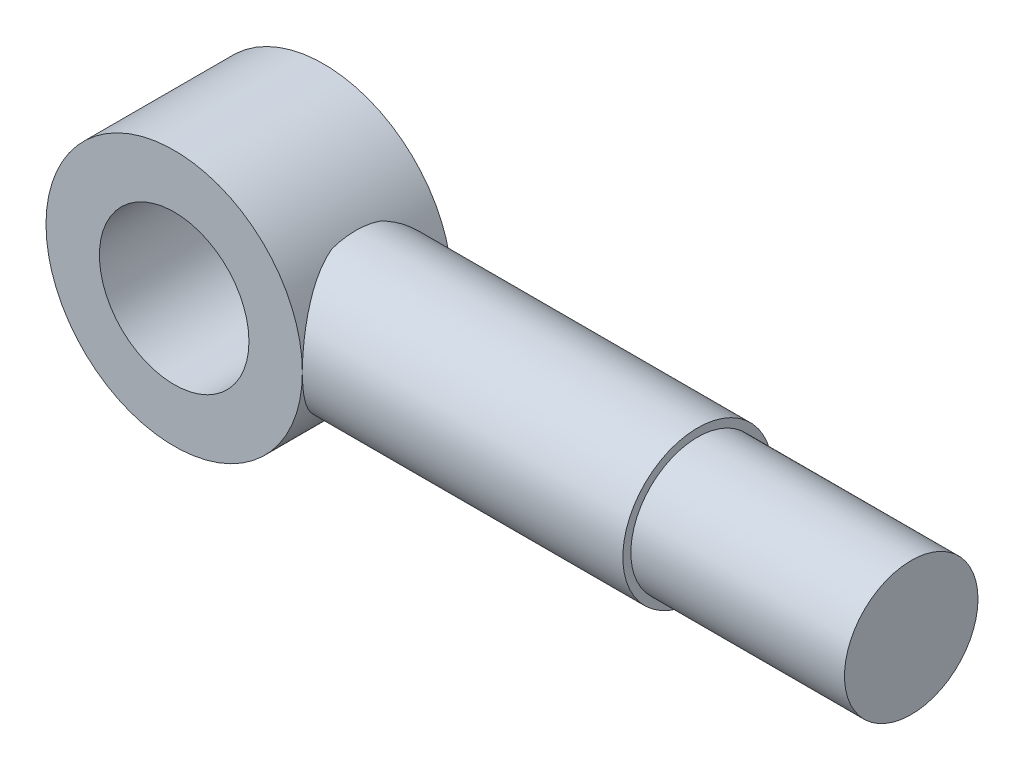
ISO-10303-21;
HEADER;
FILE_DESCRIPTION(('STEP AP214'),'2;1');
FILE_NAME('part.step','',(''),(''),'','','');
FILE_SCHEMA(('AUTOMOTIVE_DESIGN { 1 0 10303 214 1 1 1 1 }'));
ENDSEC;
DATA;
#1=APPLICATION_CONTEXT('core data for automotive mechanical design processes');
#2=APPLICATION_PROTOCOL_DEFINITION('international standard','automotive_design',2000,#1);
#3=PRODUCT_CONTEXT('',#1,'mechanical');
#4=PRODUCT('Part','Part','',(#3));
#5=PRODUCT_RELATED_PRODUCT_CATEGORY('part','',(#4));
#6=PRODUCT_DEFINITION_FORMATION('','',#4);
#7=PRODUCT_DEFINITION_CONTEXT('part definition',#1,'design');
#8=PRODUCT_DEFINITION('design','',#6,#7);
#9=PRODUCT_DEFINITION_SHAPE('','',#8);
#10=(LENGTH_UNIT() NAMED_UNIT(*) SI_UNIT(.MILLI.,.METRE.));
#11=(NAMED_UNIT(*) PLANE_ANGLE_UNIT() SI_UNIT($,.RADIAN.));
#12=(NAMED_UNIT(*) SI_UNIT($,.STERADIAN.) SOLID_ANGLE_UNIT());
#13=UNCERTAINTY_MEASURE_WITH_UNIT(LENGTH_MEASURE(1.E-05),#10,'distance_accuracy_value','');
#14=(GEOMETRIC_REPRESENTATION_CONTEXT(3) GLOBAL_UNCERTAINTY_ASSIGNED_CONTEXT((#13)) GLOBAL_UNIT_ASSIGNED_CONTEXT((#10,
#11,#12)) REPRESENTATION_CONTEXT('',''));
#15=CARTESIAN_POINT('',(0.,0.,0.));
#16=DIRECTION('',(0.,0.,1.));
#17=DIRECTION('',(1.,0.,0.));
#18=AXIS2_PLACEMENT_3D('',#15,#16,#17);
#19=CARTESIAN_POINT('',(0.,0.,14.));
#20=DIRECTION('',(0.,0.,-1.));
#21=DIRECTION('',(-1.,0.,0.));
#22=AXIS2_PLACEMENT_3D('',#19,#20,#21);
#23=CYLINDRICAL_SURFACE('',#22,24.);
#24=CARTESIAN_POINT('',(20.,13.2664991614216,4.47213595499958));
#25=CARTESIAN_POINT('',(20.0861451021514,13.1366052361754,4.85748435865611));
#26=CARTESIAN_POINT('',(20.1812031479011,12.9905857399258,5.23517124304459));
#27=CARTESIAN_POINT('',(20.385107529796,12.6682224526374,5.97310973122328));
#28=CARTESIAN_POINT('',(20.4939415991641,12.4919055903697,6.33337645703463));
#29=CARTESIAN_POINT('',(20.721369510892,12.1109017769746,7.03456541035719));
#30=CARTESIAN_POINT('',(20.8399496598083,11.9062543630985,7.37551367945539));
#31=CARTESIAN_POINT('',(21.0832796775799,11.469862549984,8.03737566912959));
#32=CARTESIAN_POINT('',(21.2080310428998,11.2381115596009,8.35828448721443));
#33=CARTESIAN_POINT('',(21.4597619744007,10.7495995474254,8.97782123447662));
#34=CARTESIAN_POINT('',(21.5867338805693,10.4929143324596,9.27651210762173));
#35=CARTESIAN_POINT('',(21.8399399121085,9.95516634292238,9.85137320924384));
#36=CARTESIAN_POINT('',(21.9661740949437,9.67410549483822,10.1275452141207));
#37=CARTESIAN_POINT('',(22.2148687504275,9.08850235023636,10.6562115910618));
#38=CARTESIAN_POINT('',(22.3373260466343,8.7839410045742,10.9086863792299));
#39=CARTESIAN_POINT('',(22.5753386686836,8.15278087922915,11.3881172443917));
#40=CARTESIAN_POINT('',(22.6908937311021,7.82618125946695,11.6150723477175));
#41=CARTESIAN_POINT('',(22.9163184450285,7.13985927796907,12.0496239138058));
#42=CARTESIAN_POINT('',(23.0258160320139,6.77935630648317,12.2561844971954));
#43=CARTESIAN_POINT('',(23.2311700960492,6.03825791559565,12.6377658854235));
#44=CARTESIAN_POINT('',(23.327026072096,5.657661758953,12.8127855319491));
#45=CARTESIAN_POINT('',(23.5021286852478,4.87942820805403,13.1288746943868));
#46=CARTESIAN_POINT('',(23.5813940796246,4.48181067774556,13.2699825779132));
#47=CARTESIAN_POINT('',(23.7209197945053,3.67239695955695,13.5163739835498));
#48=CARTESIAN_POINT('',(23.7811833920042,3.26060323006486,13.6216636830077));
#49=CARTESIAN_POINT('',(23.874777551171,2.47628220425792,13.7843701746721));
#50=CARTESIAN_POINT('',(23.9104572587262,2.1049020113245,13.8459883189527));
#51=CARTESIAN_POINT('',(23.9645281926367,1.35714478809609,13.9391557685988));
#52=CARTESIAN_POINT('',(23.9829208665509,0.980768178861459,13.9707075916214));
#53=CARTESIAN_POINT('',(24.0018971708073,0.226392931313937,14.0032581992776));
#54=CARTESIAN_POINT('',(24.002487544451,-0.151605038581677,14.0042685526603));
#55=CARTESIAN_POINT('',(23.9858587534124,-0.90604310650794,13.9757489670477));
#56=CARTESIAN_POINT('',(23.9686404259519,-1.28248327693851,13.9462204637438));
#57=CARTESIAN_POINT('',(23.9193046733611,-1.99561448601586,13.8612479921678));
#58=CARTESIAN_POINT('',(23.8887278583463,-2.33273616929745,13.8084800907276));
#59=CARTESIAN_POINT('',(23.8140376374339,-3.00075837526903,13.6788594666948));
#60=CARTESIAN_POINT('',(23.7699253158685,-3.33165939404497,13.6020086733769));
#61=CARTESIAN_POINT('',(23.6691264209122,-3.98519582908882,13.4250819887307));
#62=CARTESIAN_POINT('',(23.6124404313594,-4.30783162836327,13.3250071757626));
#63=CARTESIAN_POINT('',(23.4876720717832,-4.94308195859805,13.1026411836396));
#64=CARTESIAN_POINT('',(23.4195891134887,-5.25569597127649,12.980348857668));
#65=CARTESIAN_POINT('',(23.2702687897328,-5.88240748192235,12.7090040619765));
#66=CARTESIAN_POINT('',(23.1885955386401,-6.19600405585501,12.5590356249693));
#67=CARTESIAN_POINT('',(23.0159992239055,-6.80920347151055,12.2374273722202));
#68=CARTESIAN_POINT('',(22.9250759715538,-7.10880602755847,12.0657871143327));
#69=CARTESIAN_POINT('',(22.7356871231695,-7.69304229187165,11.7019491344501));
#70=CARTESIAN_POINT('',(22.6372163899575,-7.97766557824077,11.5097373745891));
#71=CARTESIAN_POINT('',(22.4346076162339,-8.53083770882685,11.1059500845189));
#72=CARTESIAN_POINT('',(22.3304675172161,-8.79938063905521,10.8943675016353));
#73=CARTESIAN_POINT('',(22.1048409623251,-9.35288250591816,10.4245738988492));
#74=CARTESIAN_POINT('',(21.9828449665405,-9.63551732391754,10.1638647302519));
#75=CARTESIAN_POINT('',(21.7369834573288,-10.1780286129731,9.62055837003077));
#76=CARTESIAN_POINT('',(21.6131178138099,-10.4379034917358,9.33795964960818));
#77=CARTESIAN_POINT('',(21.3666529376381,-10.9335565952705,8.75238843884696));
#78=CARTESIAN_POINT('',(21.2440525153245,-11.1693597529288,8.44943757945538));
#79=CARTESIAN_POINT('',(21.0031937020703,-11.615946631746,7.82415492315267));
#80=CARTESIAN_POINT('',(20.8849342079688,-11.8267367403067,7.50182810595197));
#81=CARTESIAN_POINT('',(20.6248141345151,-12.2760572376809,6.74830671965063));
#82=CARTESIAN_POINT('',(20.4853116529447,-12.5064775472706,6.31139337078983));
#83=CARTESIAN_POINT('',(20.226026142616,-12.9215969946511,5.41093681859816));
#84=CARTESIAN_POINT('',(20.1062414860759,-13.1062999072223,4.94739581774777));
#85=CARTESIAN_POINT('',(20.,-13.2664991614216,4.47213595499958));
#86=B_SPLINE_CURVE_WITH_KNOTS('',3,(#24,#25,#26,#27,#28,#29,#30,#31,#32,#33,#34,#35,#36,#37,#38,
#39,#40,#41,#42,#43,#44,#45,#46,#47,#48,#49,#50,#51,#52,#53,#54,#55,#56,#57,#58,#59,#60,#61,#62,
#63,#64,#65,#66,#67,#68,#69,#70,#71,#72,#73,#74,#75,#76,#77,#78,#79,#80,#81,#82,#83,#84,#85),
.UNSPECIFIED.,.F.,.F.,(4,2,2,2,2,2,2,2,2,2,2,2,2,2,2,2,2,2,2,2,2,2,2,2,2,2,2,2,2,2,4),(0.,
1.2462426317129,2.49138325948648,3.7348034033671,4.97852655783342,6.21858023763524,
7.45853600103247,8.69950763091497,9.94052659227892,11.2277685693201,12.5150578095522,
13.800883686759,15.0864876927154,16.2193590994968,17.3521356349358,18.484483082583,
19.6167772987847,20.6433884146136,21.6699173098855,22.6963985499101,23.7229327895881,
24.7930666194924,25.8632222856528,26.9341129326842,28.0053950400416,29.2143231998117,
30.4233358691773,31.6310832891729,32.8385216286855,34.3752199050615,35.9117912574372),.UNSPECIFIED.);
#87=CARTESIAN_POINT('',(24.,0.,14.));
#88=VERTEX_POINT('',#87);
#89=CARTESIAN_POINT('',(20.,-13.2664991614216,4.47213595499955));
#90=VERTEX_POINT('',#89);
#91=EDGE_CURVE('E12',#88,#90,#86,.T.);
#92=ORIENTED_EDGE('',*,*,#91,.F.);
#93=CARTESIAN_POINT('',(0.,0.,14.));
#94=DIRECTION('',(0.,0.,1.));
#95=DIRECTION('',(1.,0.,0.));
#96=AXIS2_PLACEMENT_3D('',#93,#94,#95);
#97=CIRCLE('',#96,24.);
#98=EDGE_CURVE('E75',#88,#88,#97,.T.);
#99=ORIENTED_EDGE('',*,*,#98,.F.);
#100=CARTESIAN_POINT('',(20.,13.2664991614216,4.47213595499955));
#101=VERTEX_POINT('',#100);
#102=EDGE_CURVE('E48',#101,#88,#86,.T.);
#103=ORIENTED_EDGE('',*,*,#102,.F.);
#104=DIRECTION('',(0.,0.,-1.));
#105=VECTOR('',#104,1.);
#106=CARTESIAN_POINT('',(20.,13.2664991614216,14.));
#107=LINE('',#106,#105);
#108=CARTESIAN_POINT('',(20.,13.2664991614216,-4.47213595499955));
#109=VERTEX_POINT('',#108);
#110=EDGE_CURVE('E72',#109,#101,#107,.F.);
#111=ORIENTED_EDGE('',*,*,#110,.F.);
#112=CARTESIAN_POINT('',(20.,-13.2664991614216,-4.47213595499958));
#113=CARTESIAN_POINT('',(20.0861451021514,-13.1366052361754,-4.85748435865611));
#114=CARTESIAN_POINT('',(20.1812031479011,-12.9905857399258,-5.23517124304459));
#115=CARTESIAN_POINT('',(20.385107529796,-12.6682224526374,-5.97310973122328));
#116=CARTESIAN_POINT('',(20.4939415991641,-12.4919055903697,-6.33337645703463));
#117=CARTESIAN_POINT('',(20.721369510892,-12.1109017769746,-7.03456541035719));
#118=CARTESIAN_POINT('',(20.8399496598083,-11.9062543630985,-7.37551367945539));
#119=CARTESIAN_POINT('',(21.0832796775799,-11.469862549984,-8.03737566912959));
#120=CARTESIAN_POINT('',(21.2080310428998,-11.2381115596009,-8.35828448721443));
#121=CARTESIAN_POINT('',(21.4597619744007,-10.7495995474254,-8.97782123447662));
#122=CARTESIAN_POINT('',(21.5867338805693,-10.4929143324596,-9.27651210762173));
#123=CARTESIAN_POINT('',(21.8399399121085,-9.95516634292238,-9.85137320924384));
#124=CARTESIAN_POINT('',(21.9661740949437,-9.67410549483822,-10.1275452141207));
#125=CARTESIAN_POINT('',(22.2148687504275,-9.08850235023636,-10.6562115910618));
#126=CARTESIAN_POINT('',(22.3373260466343,-8.7839410045742,-10.9086863792299));
#127=CARTESIAN_POINT('',(22.5753386686836,-8.15278087922915,-11.3881172443917));
#128=CARTESIAN_POINT('',(22.6908937311021,-7.82618125946695,-11.6150723477175));
#129=CARTESIAN_POINT('',(22.9163184450285,-7.13985927796907,-12.0496239138058));
#130=CARTESIAN_POINT('',(23.0258160320139,-6.77935630648317,-12.2561844971954));
#131=CARTESIAN_POINT('',(23.2311700960492,-6.03825791559565,-12.6377658854235));
#132=CARTESIAN_POINT('',(23.327026072096,-5.657661758953,-12.8127855319491));
#133=CARTESIAN_POINT('',(23.5021286852478,-4.87942820805403,-13.1288746943868));
#134=CARTESIAN_POINT('',(23.5813940796246,-4.48181067774556,-13.2699825779132));
#135=CARTESIAN_POINT('',(23.7209197945053,-3.67239695955695,-13.5163739835498));
#136=CARTESIAN_POINT('',(23.7811833920042,-3.26060323006486,-13.6216636830077));
#137=CARTESIAN_POINT('',(23.874777551171,-2.47628220425792,-13.7843701746721));
#138=CARTESIAN_POINT('',(23.9104572587262,-2.1049020113245,-13.8459883189527));
#139=CARTESIAN_POINT('',(23.9645281926367,-1.35714478809609,-13.9391557685988));
#140=CARTESIAN_POINT('',(23.9829208665509,-0.980768178861459,-13.9707075916214));
#141=CARTESIAN_POINT('',(24.0018971708073,-0.226392931313937,-14.0032581992776));
#142=CARTESIAN_POINT('',(24.002487544451,0.151605038581677,-14.0042685526603));
#143=CARTESIAN_POINT('',(23.9858587534124,0.90604310650794,-13.9757489670477));
#144=CARTESIAN_POINT('',(23.9686404259519,1.28248327693851,-13.9462204637438));
#145=CARTESIAN_POINT('',(23.9193046733611,1.99561448601586,-13.8612479921678));
#146=CARTESIAN_POINT('',(23.8887278583463,2.33273616929745,-13.8084800907276));
#147=CARTESIAN_POINT('',(23.8140376374339,3.00075837526903,-13.6788594666948));
#148=CARTESIAN_POINT('',(23.7699253158685,3.33165939404497,-13.6020086733769));
#149=CARTESIAN_POINT('',(23.6691264209122,3.98519582908882,-13.4250819887307));
#150=CARTESIAN_POINT('',(23.6124404313594,4.30783162836327,-13.3250071757626));
#151=CARTESIAN_POINT('',(23.4876720717832,4.94308195859805,-13.1026411836396));
#152=CARTESIAN_POINT('',(23.4195891134887,5.25569597127649,-12.980348857668));
#153=CARTESIAN_POINT('',(23.2702687897328,5.88240748192235,-12.7090040619765));
#154=CARTESIAN_POINT('',(23.1885955386401,6.19600405585501,-12.5590356249693));
#155=CARTESIAN_POINT('',(23.0159992239055,6.80920347151055,-12.2374273722202));
#156=CARTESIAN_POINT('',(22.9250759715538,7.10880602755847,-12.0657871143327));
#157=CARTESIAN_POINT('',(22.7356871231695,7.69304229187165,-11.7019491344501));
#158=CARTESIAN_POINT('',(22.6372163899575,7.97766557824077,-11.5097373745891));
#159=CARTESIAN_POINT('',(22.4346076162339,8.53083770882685,-11.1059500845189));
#160=CARTESIAN_POINT('',(22.3304675172161,8.79938063905521,-10.8943675016353));
#161=CARTESIAN_POINT('',(22.1048409623251,9.35288250591816,-10.4245738988492));
#162=CARTESIAN_POINT('',(21.9828449665405,9.63551732391754,-10.1638647302519));
#163=CARTESIAN_POINT('',(21.7369834573288,10.1780286129731,-9.62055837003077));
#164=CARTESIAN_POINT('',(21.6131178138099,10.4379034917358,-9.33795964960818));
#165=CARTESIAN_POINT('',(21.3666529376381,10.9335565952705,-8.75238843884696));
#166=CARTESIAN_POINT('',(21.2440525153245,11.1693597529288,-8.44943757945538));
#167=CARTESIAN_POINT('',(21.0031937020703,11.615946631746,-7.82415492315267));
#168=CARTESIAN_POINT('',(20.8849342079688,11.8267367403067,-7.50182810595197));
#169=CARTESIAN_POINT('',(20.6248141345151,12.2760572376809,-6.74830671965063));
#170=CARTESIAN_POINT('',(20.4853116529447,12.5064775472706,-6.31139337078983));
#171=CARTESIAN_POINT('',(20.226026142616,12.9215969946511,-5.41093681859816));
#172=CARTESIAN_POINT('',(20.1062414860759,13.1062999072223,-4.94739581774777));
#173=CARTESIAN_POINT('',(20.,13.2664991614216,-4.47213595499958));
#174=B_SPLINE_CURVE_WITH_KNOTS('',3,(#112,#113,#114,#115,#116,#117,#118,#119,#120,#121,#122,
#123,#124,#125,#126,#127,#128,#129,#130,#131,#132,#133,#134,#135,#136,#137,#138,#139,#140,#141,
#142,#143,#144,#145,#146,#147,#148,#149,#150,#151,#152,#153,#154,#155,#156,#157,#158,#159,#160,
#161,#162,#163,#164,#165,#166,#167,#168,#169,#170,#171,#172,#173),.UNSPECIFIED.,.F.,.F.,(4,2,2,
2,2,2,2,2,2,2,2,2,2,2,2,2,2,2,2,2,2,2,2,2,2,2,2,2,2,2,4),(0.,1.2462426317129,2.49138325948648,
3.7348034033671,4.97852655783342,6.21858023763524,7.45853600103247,8.69950763091497,
9.94052659227892,11.2277685693201,12.5150578095522,13.800883686759,15.0864876927154,
16.2193590994968,17.3521356349358,18.484483082583,19.6167772987847,20.6433884146136,
21.6699173098855,22.6963985499101,23.7229327895881,24.7930666194924,25.8632222856528,
26.9341129326842,28.0053950400416,29.2143231998117,30.4233358691773,31.6310832891729,
32.8385216286855,34.3752199050615,35.9117912574372),.UNSPECIFIED.);
#175=CARTESIAN_POINT('',(24.,0.,-14.));
#176=VERTEX_POINT('',#175);
#177=EDGE_CURVE('E82',#176,#109,#174,.T.);
#178=ORIENTED_EDGE('',*,*,#177,.F.);
#179=CARTESIAN_POINT('',(0.,0.,-14.));
#180=DIRECTION('',(0.,0.,1.));
#181=DIRECTION('',(1.,0.,0.));
#182=AXIS2_PLACEMENT_3D('',#179,#180,#181);
#183=CIRCLE('',#182,24.);
#184=EDGE_CURVE('E98',#176,#176,#183,.T.);
#185=ORIENTED_EDGE('',*,*,#184,.T.);
#186=CARTESIAN_POINT('',(20.,-13.2664991614216,-4.47213595499958));
#187=VERTEX_POINT('',#186);
#188=EDGE_CURVE('E58',#187,#176,#174,.T.);
#189=ORIENTED_EDGE('',*,*,#188,.F.);
#190=DIRECTION('',(0.,0.,-1.));
#191=VECTOR('',#190,1.);
#192=CARTESIAN_POINT('',(20.,-13.2664991614216,14.));
#193=LINE('',#192,#191);
#194=EDGE_CURVE('E43',#90,#187,#193,.T.);
#195=ORIENTED_EDGE('',*,*,#194,.F.);
#196=EDGE_LOOP('',(#92,#99,#103,#111,#178,#185,#189,#195));
#197=FACE_BOUND('',#196,.T.);
#198=ADVANCED_FACE('F39',(#197),#23,.T.);
#199=CARTESIAN_POINT('',(0.,0.,14.));
#200=DIRECTION('',(0.,0.,1.));
#201=DIRECTION('',(1.,0.,0.));
#202=AXIS2_PLACEMENT_3D('',#199,#200,#201);
#203=PLANE('',#202);
#204=ORIENTED_EDGE('',*,*,#98,.T.);
#205=EDGE_LOOP('',(#204));
#206=FACE_BOUND('',#205,.T.);
#207=CARTESIAN_POINT('',(0.,0.,14.));
#208=DIRECTION('',(0.,0.,1.));
#209=DIRECTION('',(1.,0.,0.));
#210=AXIS2_PLACEMENT_3D('',#207,#208,#209);
#211=CIRCLE('',#210,14.);
#212=CARTESIAN_POINT('',(14.,0.,14.));
#213=VERTEX_POINT('',#212);
#214=EDGE_CURVE('E95',#213,#213,#211,.T.);
#215=ORIENTED_EDGE('',*,*,#214,.F.);
#216=EDGE_LOOP('',(#215));
#217=FACE_BOUND('',#216,.T.);
#218=ADVANCED_FACE('F123',(#206,#217),#203,.T.);
#219=CARTESIAN_POINT('',(0.,0.,-14.));
#220=DIRECTION('',(0.,0.,1.));
#221=DIRECTION('',(1.,0.,0.));
#222=AXIS2_PLACEMENT_3D('',#219,#220,#221);
#223=PLANE('',#222);
#224=ORIENTED_EDGE('',*,*,#184,.F.);
#225=EDGE_LOOP('',(#224));
#226=FACE_BOUND('',#225,.T.);
#227=CARTESIAN_POINT('',(0.,0.,-14.));
#228=DIRECTION('',(0.,0.,1.));
#229=DIRECTION('',(1.,0.,0.));
#230=AXIS2_PLACEMENT_3D('',#227,#228,#229);
#231=CIRCLE('',#230,14.);
#232=CARTESIAN_POINT('',(14.,0.,-14.));
#233=VERTEX_POINT('',#232);
#234=EDGE_CURVE('E89',#233,#233,#231,.T.);
#235=ORIENTED_EDGE('',*,*,#234,.T.);
#236=EDGE_LOOP('',(#235));
#237=FACE_BOUND('',#236,.T.);
#238=ADVANCED_FACE('F121',(#226,#237),#223,.F.);
#239=CARTESIAN_POINT('',(0.,0.,14.));
#240=DIRECTION('',(0.,0.,-1.));
#241=DIRECTION('',(-1.,0.,0.));
#242=AXIS2_PLACEMENT_3D('',#239,#240,#241);
#243=CYLINDRICAL_SURFACE('',#242,14.);
#244=ORIENTED_EDGE('',*,*,#214,.T.);
#245=EDGE_LOOP('',(#244));
#246=FACE_BOUND('',#245,.T.);
#247=ORIENTED_EDGE('',*,*,#234,.F.);
#248=EDGE_LOOP('',(#247));
#249=FACE_BOUND('',#248,.T.);
#250=ADVANCED_FACE('F115',(#246,#249),#243,.F.);
#251=CARTESIAN_POINT('',(84.,0.,0.));
#252=DIRECTION('',(-1.,0.,0.));
#253=DIRECTION('',(0.,0.,1.));
#254=AXIS2_PLACEMENT_3D('',#251,#252,#253);
#255=CYLINDRICAL_SURFACE('',#254,14.);
#256=CARTESIAN_POINT('',(84.,0.,0.));
#257=DIRECTION('',(1.,0.,0.));
#258=DIRECTION('',(0.,0.,-1.));
#259=AXIS2_PLACEMENT_3D('',#256,#257,#258);
#260=CIRCLE('',#259,14.);
#261=CARTESIAN_POINT('',(84.,0.,-14.));
#262=VERTEX_POINT('',#261);
#263=EDGE_CURVE('E85',#262,#262,#260,.T.);
#264=ORIENTED_EDGE('',*,*,#263,.F.);
#265=EDGE_LOOP('',(#264));
#266=FACE_BOUND('',#265,.T.);
#267=CARTESIAN_POINT('',(20.,0.,0.));
#268=DIRECTION('',(1.,0.,0.));
#269=DIRECTION('',(0.,0.,-1.));
#270=AXIS2_PLACEMENT_3D('',#267,#268,#269);
#271=CIRCLE('',#270,14.);
#272=EDGE_CURVE('E81',#109,#101,#271,.T.);
#273=ORIENTED_EDGE('',*,*,#272,.T.);
#274=ORIENTED_EDGE('',*,*,#102,.T.);
#275=ORIENTED_EDGE('',*,*,#91,.T.);
#276=EDGE_CURVE('E86',#90,#187,#271,.T.);
#277=ORIENTED_EDGE('',*,*,#276,.T.);
#278=ORIENTED_EDGE('',*,*,#188,.T.);
#279=ORIENTED_EDGE('',*,*,#177,.T.);
#280=EDGE_LOOP('',(#273,#274,#275,#277,#278,#279));
#281=FACE_BOUND('',#280,.T.);
#282=ADVANCED_FACE('F84',(#266,#281),#255,.T.);
#283=CARTESIAN_POINT('',(20.,0.,0.));
#284=DIRECTION('',(1.,0.,0.));
#285=DIRECTION('',(0.,0.,-1.));
#286=AXIS2_PLACEMENT_3D('',#283,#284,#285);
#287=PLANE('',#286);
#288=ORIENTED_EDGE('',*,*,#276,.F.);
#289=ORIENTED_EDGE('',*,*,#194,.T.);
#290=EDGE_LOOP('',(#288,#289));
#291=FACE_BOUND('',#290,.T.);
#292=ADVANCED_FACE('F114',(#291),#287,.F.);
#293=ORIENTED_EDGE('',*,*,#272,.F.);
#294=ORIENTED_EDGE('',*,*,#110,.T.);
#295=EDGE_LOOP('',(#293,#294));
#296=FACE_BOUND('',#295,.T.);
#297=ADVANCED_FACE('F80',(#296),#287,.F.);
#298=CARTESIAN_POINT('',(84.,0.,0.));
#299=DIRECTION('',(1.,0.,0.));
#300=DIRECTION('',(0.,0.,-1.));
#301=AXIS2_PLACEMENT_3D('',#298,#299,#300);
#302=PLANE('',#301);
#303=CARTESIAN_POINT('',(84.,0.,0.));
#304=DIRECTION('',(1.,0.,0.));
#305=DIRECTION('',(0.,0.,-1.));
#306=AXIS2_PLACEMENT_3D('',#303,#304,#305);
#307=CIRCLE('',#306,12.5);
#308=CARTESIAN_POINT('',(84.,0.,-12.5));
#309=VERTEX_POINT('',#308);
#310=EDGE_CURVE('E201',#309,#309,#307,.T.);
#311=ORIENTED_EDGE('',*,*,#310,.F.);
#312=EDGE_LOOP('',(#311));
#313=FACE_BOUND('',#312,.T.);
#314=ORIENTED_EDGE('',*,*,#263,.T.);
#315=EDGE_LOOP('',(#314));
#316=FACE_BOUND('',#315,.T.);
#317=ADVANCED_FACE('F168',(#313,#316),#302,.T.);
#318=CARTESIAN_POINT('',(124.,0.,0.));
#319=DIRECTION('',(-1.,0.,0.));
#320=DIRECTION('',(0.,0.,1.));
#321=AXIS2_PLACEMENT_3D('',#318,#319,#320);
#322=CYLINDRICAL_SURFACE('',#321,12.5);
#323=CARTESIAN_POINT('',(124.,0.,0.));
#324=DIRECTION('',(1.,0.,0.));
#325=DIRECTION('',(0.,0.,-1.));
#326=AXIS2_PLACEMENT_3D('',#323,#324,#325);
#327=CIRCLE('',#326,12.5);
#328=CARTESIAN_POINT('',(124.,0.,-12.5));
#329=VERTEX_POINT('',#328);
#330=EDGE_CURVE('E92',#329,#329,#327,.T.);
#331=ORIENTED_EDGE('',*,*,#330,.F.);
#332=EDGE_LOOP('',(#331));
#333=FACE_BOUND('',#332,.T.);
#334=ORIENTED_EDGE('',*,*,#310,.T.);
#335=EDGE_LOOP('',(#334));
#336=FACE_BOUND('',#335,.T.);
#337=ADVANCED_FACE('F176',(#333,#336),#322,.T.);
#338=CARTESIAN_POINT('',(124.,0.,0.));
#339=DIRECTION('',(1.,0.,0.));
#340=DIRECTION('',(0.,0.,-1.));
#341=AXIS2_PLACEMENT_3D('',#338,#339,#340);
#342=PLANE('',#341);
#343=ORIENTED_EDGE('',*,*,#330,.T.);
#344=EDGE_LOOP('',(#343));
#345=FACE_BOUND('',#344,.T.);
#346=ADVANCED_FACE('F185',(#345),#342,.T.);
#347=CLOSED_SHELL('',(#198,#218,#238,#250,#282,#292,#297,#317,#337,#346));
#348=MANIFOLD_SOLID_BREP('B2',#347);
#349=ADVANCED_BREP_SHAPE_REPRESENTATION('',(#18,#348),#14);
#350=SHAPE_DEFINITION_REPRESENTATION(#9,#349);
ENDSEC;
END-ISO-10303-21;
